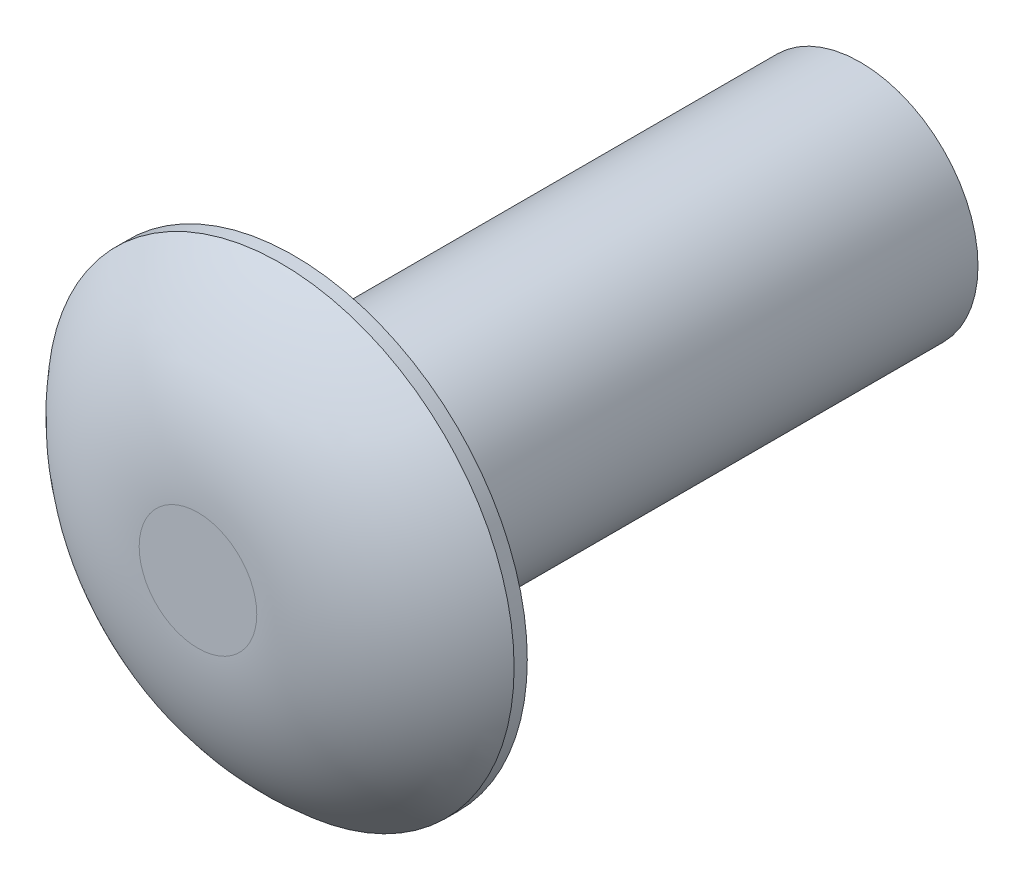
ISO-10303-21;
HEADER;
FILE_DESCRIPTION(('STEP AP214'),'2;1');
FILE_NAME('part.step','',(''),(''),'','','');
FILE_SCHEMA(('AUTOMOTIVE_DESIGN { 1 0 10303 214 1 1 1 1 }'));
ENDSEC;
DATA;
#1=APPLICATION_CONTEXT('core data for automotive mechanical design processes');
#2=APPLICATION_PROTOCOL_DEFINITION('international standard','automotive_design',2000,#1);
#3=PRODUCT_CONTEXT('',#1,'mechanical');
#4=PRODUCT('Part','Part','',(#3));
#5=PRODUCT_RELATED_PRODUCT_CATEGORY('part','',(#4));
#6=PRODUCT_DEFINITION_FORMATION('','',#4);
#7=PRODUCT_DEFINITION_CONTEXT('part definition',#1,'design');
#8=PRODUCT_DEFINITION('design','',#6,#7);
#9=PRODUCT_DEFINITION_SHAPE('','',#8);
#10=(LENGTH_UNIT() NAMED_UNIT(*) SI_UNIT(.MILLI.,.METRE.));
#11=(NAMED_UNIT(*) PLANE_ANGLE_UNIT() SI_UNIT($,.RADIAN.));
#12=(NAMED_UNIT(*) SI_UNIT($,.STERADIAN.) SOLID_ANGLE_UNIT());
#13=UNCERTAINTY_MEASURE_WITH_UNIT(LENGTH_MEASURE(1.E-05),#10,'distance_accuracy_value','');
#14=(GEOMETRIC_REPRESENTATION_CONTEXT(3) GLOBAL_UNCERTAINTY_ASSIGNED_CONTEXT((#13)) GLOBAL_UNIT_ASSIGNED_CONTEXT((#10,
#11,#12)) REPRESENTATION_CONTEXT('',''));
#15=CARTESIAN_POINT('',(0.,0.,0.));
#16=DIRECTION('',(0.,0.,1.));
#17=DIRECTION('',(1.,0.,0.));
#18=AXIS2_PLACEMENT_3D('',#15,#16,#17);
#19=CARTESIAN_POINT('',(0.,1.49670935351153,-7.6454));
#20=DIRECTION('',(0.,0.,1.));
#21=DIRECTION('',(1.,0.,0.));
#22=AXIS2_PLACEMENT_3D('',#19,#20,#21);
#23=PLANE('',#22);
#24=CARTESIAN_POINT('',(0.,0.,-7.6454));
#25=DIRECTION('',(0.,0.,1.));
#26=DIRECTION('',(1.,0.,0.));
#27=AXIS2_PLACEMENT_3D('',#24,#25,#26);
#28=CIRCLE('',#27,1.5875);
#29=CARTESIAN_POINT('',(1.5875,0.,-7.6454));
#30=VERTEX_POINT('',#29);
#31=EDGE_CURVE('E47',#30,#30,#28,.T.);
#32=ORIENTED_EDGE('',*,*,#31,.F.);
#33=EDGE_LOOP('',(#32));
#34=FACE_BOUND('',#33,.T.);
#35=ADVANCED_FACE('F36',(#34),#23,.F.);
#36=CARTESIAN_POINT('',(0.,0.,16.5862));
#37=DIRECTION('',(0.,0.,1.));
#38=DIRECTION('',(1.,0.,0.));
#39=AXIS2_PLACEMENT_3D('',#36,#37,#38);
#40=CYLINDRICAL_SURFACE('',#39,1.5875);
#41=CARTESIAN_POINT('',(0.,0.,-0.254000000000001));
#42=DIRECTION('',(0.,0.,1.));
#43=DIRECTION('',(1.,0.,0.));
#44=AXIS2_PLACEMENT_3D('',#41,#42,#43);
#45=CIRCLE('',#44,1.5875);
#46=CARTESIAN_POINT('',(1.5875,0.,-0.254000000000001));
#47=VERTEX_POINT('',#46);
#48=EDGE_CURVE('E10',#47,#47,#45,.F.);
#49=ORIENTED_EDGE('',*,*,#48,.T.);
#50=EDGE_LOOP('',(#49));
#51=FACE_BOUND('',#50,.T.);
#52=ORIENTED_EDGE('',*,*,#31,.T.);
#53=EDGE_LOOP('',(#52));
#54=FACE_BOUND('',#53,.T.);
#55=ADVANCED_FACE('F75',(#51,#54),#40,.T.);
#56=CARTESIAN_POINT('',(0.,1.5875,0.));
#57=DIRECTION('',(0.,0.,1.));
#58=DIRECTION('',(1.,0.,0.));
#59=AXIS2_PLACEMENT_3D('',#56,#57,#58);
#60=PLANE('',#59);
#61=CARTESIAN_POINT('',(0.,0.,0.));
#62=DIRECTION('',(0.,0.,1.));
#63=DIRECTION('',(1.,0.,0.));
#64=AXIS2_PLACEMENT_3D('',#61,#62,#63);
#65=CIRCLE('',#64,1.8415);
#66=CARTESIAN_POINT('',(1.8415,0.,0.));
#67=VERTEX_POINT('',#66);
#68=EDGE_CURVE('E43',#67,#67,#65,.T.);
#69=ORIENTED_EDGE('',*,*,#68,.T.);
#70=EDGE_LOOP('',(#69));
#71=FACE_BOUND('',#70,.T.);
#72=CARTESIAN_POINT('',(0.,0.,0.));
#73=DIRECTION('',(0.,0.,1.));
#74=DIRECTION('',(1.,0.,0.));
#75=AXIS2_PLACEMENT_3D('',#72,#73,#74);
#76=CIRCLE('',#75,3.1496);
#77=CARTESIAN_POINT('',(3.1496,0.,0.));
#78=VERTEX_POINT('',#77);
#79=EDGE_CURVE('E51',#78,#78,#76,.T.);
#80=ORIENTED_EDGE('',*,*,#79,.F.);
#81=EDGE_LOOP('',(#80));
#82=FACE_BOUND('',#81,.T.);
#83=ADVANCED_FACE('F80',(#71,#82),#60,.F.);
#84=CARTESIAN_POINT('',(0.,0.,16.5862));
#85=DIRECTION('',(0.,0.,1.));
#86=DIRECTION('',(1.,0.,0.));
#87=AXIS2_PLACEMENT_3D('',#84,#85,#86);
#88=CYLINDRICAL_SURFACE('',#87,3.1496);
#89=CARTESIAN_POINT('',(0.,0.,0.177799999999999));
#90=DIRECTION('',(0.,0.,1.));
#91=DIRECTION('',(1.,0.,0.));
#92=AXIS2_PLACEMENT_3D('',#89,#90,#91);
#93=CIRCLE('',#92,3.1496);
#94=CARTESIAN_POINT('',(3.1496,0.,0.177799999999999));
#95=VERTEX_POINT('',#94);
#96=EDGE_CURVE('E56',#95,#95,#93,.T.);
#97=ORIENTED_EDGE('',*,*,#96,.F.);
#98=EDGE_LOOP('',(#97));
#99=FACE_BOUND('',#98,.T.);
#100=ORIENTED_EDGE('',*,*,#79,.T.);
#101=EDGE_LOOP('',(#100));
#102=FACE_BOUND('',#101,.T.);
#103=ADVANCED_FACE('F86',(#99,#102),#88,.T.);
#104=CARTESIAN_POINT('',(0.,0.,-1.74641235795454));
#105=DIRECTION('',(0.,0.,1.));
#106=DIRECTION('',(1.,0.,0.));
#107=AXIS2_PLACEMENT_3D('',#104,#105,#106);
#108=DEGENERATE_TOROIDAL_SURFACE('',#107,0.79375,3.04181235795454,.T.);
#109=CARTESIAN_POINT('',(0.,0.,1.2954));
#110=DIRECTION('',(0.,0.,-1.));
#111=DIRECTION('',(-1.,0.,0.));
#112=AXIS2_PLACEMENT_3D('',#109,#110,#111);
#113=CIRCLE('',#112,0.79375);
#114=CARTESIAN_POINT('',(-0.79375,0.,1.2954));
#115=VERTEX_POINT('',#114);
#116=EDGE_CURVE('E59',#115,#115,#113,.T.);
#117=ORIENTED_EDGE('',*,*,#116,.T.);
#118=EDGE_LOOP('',(#117));
#119=FACE_BOUND('',#118,.T.);
#120=ORIENTED_EDGE('',*,*,#96,.T.);
#121=EDGE_LOOP('',(#120));
#122=FACE_BOUND('',#121,.T.);
#123=ADVANCED_FACE('F63',(#119,#122),#108,.T.);
#124=CARTESIAN_POINT('',(0.,0.,-0.254000000000001));
#125=DIRECTION('',(0.,0.,1.));
#126=DIRECTION('',(1.,0.,0.));
#127=AXIS2_PLACEMENT_3D('',#124,#125,#126);
#128=TOROIDAL_SURFACE('',#127,1.8415,0.254);
#129=ORIENTED_EDGE('',*,*,#48,.F.);
#130=EDGE_LOOP('',(#129));
#131=FACE_BOUND('',#130,.T.);
#132=ORIENTED_EDGE('',*,*,#68,.F.);
#133=EDGE_LOOP('',(#132));
#134=FACE_BOUND('',#133,.T.);
#135=ADVANCED_FACE('F38',(#131,#134),#128,.F.);
#136=CARTESIAN_POINT('',(-0.79375,-3.1496,1.2954));
#137=DIRECTION('',(0.,0.,-1.));
#138=DIRECTION('',(-1.,0.,0.));
#139=AXIS2_PLACEMENT_3D('',#136,#137,#138);
#140=PLANE('',#139);
#141=ORIENTED_EDGE('',*,*,#116,.F.);
#142=EDGE_LOOP('',(#141));
#143=FACE_BOUND('',#142,.T.);
#144=ADVANCED_FACE('F66',(#143),#140,.F.);
#145=CLOSED_SHELL('',(#35,#55,#83,#103,#123,#135,#144));
#146=MANIFOLD_SOLID_BREP('B2',#145);
#147=ADVANCED_BREP_SHAPE_REPRESENTATION('',(#18,#146),#14);
#148=SHAPE_DEFINITION_REPRESENTATION(#9,#147);
ENDSEC;
END-ISO-10303-21;
